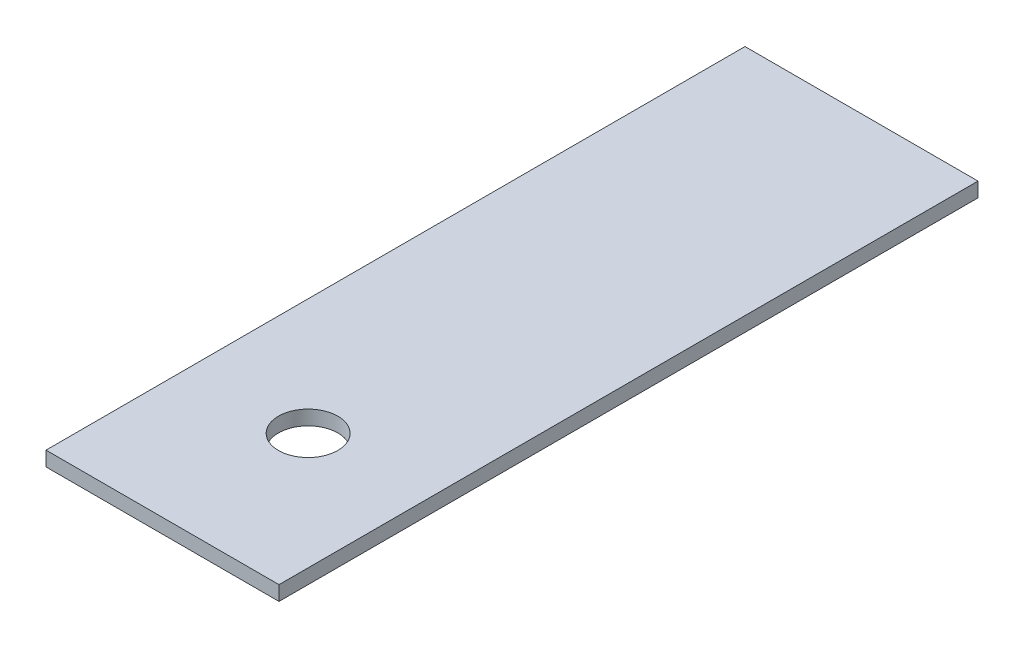
ISO-10303-21;
HEADER;
FILE_DESCRIPTION(('STEP AP214'),'2;1');
FILE_NAME('part.step','',(''),(''),'','','');
FILE_SCHEMA(('AUTOMOTIVE_DESIGN { 1 0 10303 214 1 1 1 1 }'));
ENDSEC;
DATA;
#1=APPLICATION_CONTEXT('core data for automotive mechanical design processes');
#2=APPLICATION_PROTOCOL_DEFINITION('international standard','automotive_design',2000,#1);
#3=PRODUCT_CONTEXT('',#1,'mechanical');
#4=PRODUCT('Part','Part','',(#3));
#5=PRODUCT_RELATED_PRODUCT_CATEGORY('part','',(#4));
#6=PRODUCT_DEFINITION_FORMATION('','',#4);
#7=PRODUCT_DEFINITION_CONTEXT('part definition',#1,'design');
#8=PRODUCT_DEFINITION('design','',#6,#7);
#9=PRODUCT_DEFINITION_SHAPE('','',#8);
#10=(LENGTH_UNIT() NAMED_UNIT(*) SI_UNIT(.MILLI.,.METRE.));
#11=(NAMED_UNIT(*) PLANE_ANGLE_UNIT() SI_UNIT($,.RADIAN.));
#12=(NAMED_UNIT(*) SI_UNIT($,.STERADIAN.) SOLID_ANGLE_UNIT());
#13=UNCERTAINTY_MEASURE_WITH_UNIT(LENGTH_MEASURE(1.E-05),#10,'distance_accuracy_value','');
#14=(GEOMETRIC_REPRESENTATION_CONTEXT(3) GLOBAL_UNCERTAINTY_ASSIGNED_CONTEXT((#13)) GLOBAL_UNIT_ASSIGNED_CONTEXT((#10,
#11,#12)) REPRESENTATION_CONTEXT('',''));
#15=CARTESIAN_POINT('',(0.,0.,0.));
#16=DIRECTION('',(0.,0.,1.));
#17=DIRECTION('',(1.,0.,0.));
#18=AXIS2_PLACEMENT_3D('',#15,#16,#17);
#19=CARTESIAN_POINT('',(-101.6,0.,-177.8));
#20=DIRECTION('',(0.,-1.,0.));
#21=DIRECTION('',(0.,0.,-1.));
#22=AXIS2_PLACEMENT_3D('',#19,#20,#21);
#23=PLANE('',#22);
#24=DIRECTION('',(-1.,0.,0.));
#25=VECTOR('',#24,1.);
#26=CARTESIAN_POINT('',(-101.6,0.,-330.2));
#27=LINE('',#26,#25);
#28=CARTESIAN_POINT('',(-152.4,0.,-330.2));
#29=VERTEX_POINT('',#28);
#30=CARTESIAN_POINT('',(-50.8,0.,-330.2));
#31=VERTEX_POINT('',#30);
#32=EDGE_CURVE('E86',#29,#31,#27,.F.);
#33=ORIENTED_EDGE('',*,*,#32,.F.);
#34=DIRECTION('',(0.,0.,-1.));
#35=VECTOR('',#34,1.);
#36=CARTESIAN_POINT('',(-152.4,0.,-177.8));
#37=LINE('',#36,#35);
#38=CARTESIAN_POINT('',(-152.4,0.,-25.4));
#39=VERTEX_POINT('',#38);
#40=EDGE_CURVE('E68',#29,#39,#37,.F.);
#41=ORIENTED_EDGE('',*,*,#40,.T.);
#42=DIRECTION('',(-1.,0.,0.));
#43=VECTOR('',#42,1.);
#44=CARTESIAN_POINT('',(-101.6,0.,-25.4));
#45=LINE('',#44,#43);
#46=CARTESIAN_POINT('',(-50.8,0.,-25.4));
#47=VERTEX_POINT('',#46);
#48=EDGE_CURVE('E53',#39,#47,#45,.F.);
#49=ORIENTED_EDGE('',*,*,#48,.T.);
#50=DIRECTION('',(0.,0.,-1.));
#51=VECTOR('',#50,1.);
#52=CARTESIAN_POINT('',(-50.8,0.,-177.8));
#53=LINE('',#52,#51);
#54=EDGE_CURVE('E58',#31,#47,#53,.F.);
#55=ORIENTED_EDGE('',*,*,#54,.F.);
#56=EDGE_LOOP('',(#33,#41,#49,#55));
#57=FACE_BOUND('',#56,.T.);
#58=CARTESIAN_POINT('',(-101.6,0.,-88.9));
#59=DIRECTION('',(0.,-1.,0.));
#60=DIRECTION('',(0.,0.,-1.));
#61=AXIS2_PLACEMENT_3D('',#58,#59,#60);
#62=CIRCLE('',#61,12.954);
#63=CARTESIAN_POINT('',(-101.6,0.,-101.854));
#64=VERTEX_POINT('',#63);
#65=EDGE_CURVE('E17',#64,#64,#62,.T.);
#66=ORIENTED_EDGE('',*,*,#65,.T.);
#67=EDGE_LOOP('',(#66));
#68=FACE_BOUND('',#67,.T.);
#69=ADVANCED_FACE('F14',(#57,#68),#23,.F.);
#70=CARTESIAN_POINT('',(-101.6,-325.241929822993,-88.9));
#71=DIRECTION('',(0.,-1.,0.));
#72=DIRECTION('',(0.,0.,-1.));
#73=AXIS2_PLACEMENT_3D('',#70,#71,#72);
#74=CYLINDRICAL_SURFACE('',#73,12.954);
#75=ORIENTED_EDGE('',*,*,#65,.F.);
#76=EDGE_LOOP('',(#75));
#77=FACE_BOUND('',#76,.T.);
#78=CARTESIAN_POINT('',(-101.6,-6.35000000000002,-88.9));
#79=DIRECTION('',(0.,-1.,0.));
#80=DIRECTION('',(0.,0.,-1.));
#81=AXIS2_PLACEMENT_3D('',#78,#79,#80);
#82=CIRCLE('',#81,12.954);
#83=CARTESIAN_POINT('',(-101.6,-6.35000000000002,-101.854));
#84=VERTEX_POINT('',#83);
#85=EDGE_CURVE('E78',#84,#84,#82,.F.);
#86=ORIENTED_EDGE('',*,*,#85,.F.);
#87=EDGE_LOOP('',(#86));
#88=FACE_BOUND('',#87,.T.);
#89=ADVANCED_FACE('F110',(#77,#88),#74,.F.);
#90=CARTESIAN_POINT('',(-50.8,-6.35,-177.8));
#91=DIRECTION('',(1.,0.,0.));
#92=DIRECTION('',(0.,0.,-1.));
#93=AXIS2_PLACEMENT_3D('',#90,#91,#92);
#94=PLANE('',#93);
#95=DIRECTION('',(0.,0.,-1.));
#96=VECTOR('',#95,1.);
#97=CARTESIAN_POINT('',(-50.8,-6.35,-177.8));
#98=LINE('',#97,#96);
#99=CARTESIAN_POINT('',(-50.8,-6.35,-330.2));
#100=VERTEX_POINT('',#99);
#101=CARTESIAN_POINT('',(-50.8,-6.35,-25.4));
#102=VERTEX_POINT('',#101);
#103=EDGE_CURVE('E80',#100,#102,#98,.F.);
#104=ORIENTED_EDGE('',*,*,#103,.F.);
#105=DIRECTION('',(0.,1.,0.));
#106=VECTOR('',#105,1.);
#107=CARTESIAN_POINT('',(-50.8,-6.35,-330.2));
#108=LINE('',#107,#106);
#109=EDGE_CURVE('E63',#31,#100,#108,.F.);
#110=ORIENTED_EDGE('',*,*,#109,.F.);
#111=ORIENTED_EDGE('',*,*,#54,.T.);
#112=DIRECTION('',(0.,1.,0.));
#113=VECTOR('',#112,1.);
#114=CARTESIAN_POINT('',(-50.8,-6.35,-25.4));
#115=LINE('',#114,#113);
#116=EDGE_CURVE('E60',#47,#102,#115,.F.);
#117=ORIENTED_EDGE('',*,*,#116,.T.);
#118=EDGE_LOOP('',(#104,#110,#111,#117));
#119=FACE_BOUND('',#118,.T.);
#120=ADVANCED_FACE('F59',(#119),#94,.T.);
#121=CARTESIAN_POINT('',(-101.6,-6.35,-25.4));
#122=DIRECTION('',(0.,0.,-1.));
#123=DIRECTION('',(-1.,0.,0.));
#124=AXIS2_PLACEMENT_3D('',#121,#122,#123);
#125=PLANE('',#124);
#126=DIRECTION('',(0.,1.,0.));
#127=VECTOR('',#126,1.);
#128=CARTESIAN_POINT('',(-152.4,-6.35,-25.4));
#129=LINE('',#128,#127);
#130=CARTESIAN_POINT('',(-152.4,-6.35,-25.4));
#131=VERTEX_POINT('',#130);
#132=EDGE_CURVE('E70',#39,#131,#129,.F.);
#133=ORIENTED_EDGE('',*,*,#132,.T.);
#134=DIRECTION('',(1.,0.,0.));
#135=VECTOR('',#134,1.);
#136=CARTESIAN_POINT('',(-101.6,-6.35,-25.4));
#137=LINE('',#136,#135);
#138=EDGE_CURVE('E74',#102,#131,#137,.F.);
#139=ORIENTED_EDGE('',*,*,#138,.F.);
#140=ORIENTED_EDGE('',*,*,#116,.F.);
#141=ORIENTED_EDGE('',*,*,#48,.F.);
#142=EDGE_LOOP('',(#133,#139,#140,#141));
#143=FACE_BOUND('',#142,.T.);
#144=ADVANCED_FACE('F72',(#143),#125,.F.);
#145=CARTESIAN_POINT('',(-152.4,-6.35,-177.8));
#146=DIRECTION('',(1.,0.,0.));
#147=DIRECTION('',(0.,0.,-1.));
#148=AXIS2_PLACEMENT_3D('',#145,#146,#147);
#149=PLANE('',#148);
#150=DIRECTION('',(0.,1.,0.));
#151=VECTOR('',#150,1.);
#152=CARTESIAN_POINT('',(-152.4,-6.35,-330.2));
#153=LINE('',#152,#151);
#154=CARTESIAN_POINT('',(-152.4,-6.35,-330.2));
#155=VERTEX_POINT('',#154);
#156=EDGE_CURVE('E32',#155,#29,#153,.T.);
#157=ORIENTED_EDGE('',*,*,#156,.F.);
#158=DIRECTION('',(0.,0.,-1.));
#159=VECTOR('',#158,1.);
#160=CARTESIAN_POINT('',(-152.4,-6.35,-177.8));
#161=LINE('',#160,#159);
#162=EDGE_CURVE('E23',#131,#155,#161,.T.);
#163=ORIENTED_EDGE('',*,*,#162,.F.);
#164=ORIENTED_EDGE('',*,*,#132,.F.);
#165=ORIENTED_EDGE('',*,*,#40,.F.);
#166=EDGE_LOOP('',(#157,#163,#164,#165));
#167=FACE_BOUND('',#166,.T.);
#168=ADVANCED_FACE('F92',(#167),#149,.F.);
#169=CARTESIAN_POINT('',(-101.6,-6.35,-330.2));
#170=DIRECTION('',(0.,0.,-1.));
#171=DIRECTION('',(-1.,0.,0.));
#172=AXIS2_PLACEMENT_3D('',#169,#170,#171);
#173=PLANE('',#172);
#174=DIRECTION('',(1.,0.,0.));
#175=VECTOR('',#174,1.);
#176=CARTESIAN_POINT('',(-101.6,-6.35,-330.2));
#177=LINE('',#176,#175);
#178=EDGE_CURVE('E9',#155,#100,#177,.T.);
#179=ORIENTED_EDGE('',*,*,#178,.F.);
#180=ORIENTED_EDGE('',*,*,#156,.T.);
#181=ORIENTED_EDGE('',*,*,#32,.T.);
#182=ORIENTED_EDGE('',*,*,#109,.T.);
#183=EDGE_LOOP('',(#179,#180,#181,#182));
#184=FACE_BOUND('',#183,.T.);
#185=ADVANCED_FACE('F96',(#184),#173,.T.);
#186=CARTESIAN_POINT('',(-101.6,-6.35,-177.8));
#187=DIRECTION('',(0.,-1.,0.));
#188=DIRECTION('',(0.,0.,-1.));
#189=AXIS2_PLACEMENT_3D('',#186,#187,#188);
#190=PLANE('',#189);
#191=ORIENTED_EDGE('',*,*,#162,.T.);
#192=ORIENTED_EDGE('',*,*,#178,.T.);
#193=ORIENTED_EDGE('',*,*,#103,.T.);
#194=ORIENTED_EDGE('',*,*,#138,.T.);
#195=EDGE_LOOP('',(#191,#192,#193,#194));
#196=FACE_BOUND('',#195,.T.);
#197=ORIENTED_EDGE('',*,*,#85,.T.);
#198=EDGE_LOOP('',(#197));
#199=FACE_BOUND('',#198,.T.);
#200=ADVANCED_FACE('F95',(#196,#199),#190,.T.);
#201=CLOSED_SHELL('',(#69,#89,#120,#144,#168,#185,#200));
#202=MANIFOLD_SOLID_BREP('B1',#201);
#203=ADVANCED_BREP_SHAPE_REPRESENTATION('',(#18,#202),#14);
#204=SHAPE_DEFINITION_REPRESENTATION(#9,#203);
ENDSEC;
END-ISO-10303-21;
